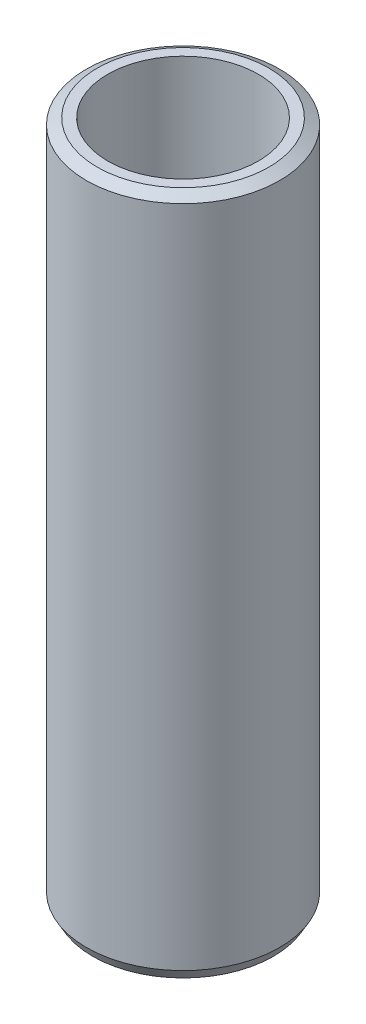
ISO-10303-21;
HEADER;
FILE_DESCRIPTION(('STEP AP214'),'2;1');
FILE_NAME('part.step','',(''),(''),'','','');
FILE_SCHEMA(('AUTOMOTIVE_DESIGN { 1 0 10303 214 1 1 1 1 }'));
ENDSEC;
DATA;
#1=APPLICATION_CONTEXT('core data for automotive mechanical design processes');
#2=APPLICATION_PROTOCOL_DEFINITION('international standard','automotive_design',2000,#1);
#3=PRODUCT_CONTEXT('',#1,'mechanical');
#4=PRODUCT('Part','Part','',(#3));
#5=PRODUCT_RELATED_PRODUCT_CATEGORY('part','',(#4));
#6=PRODUCT_DEFINITION_FORMATION('','',#4);
#7=PRODUCT_DEFINITION_CONTEXT('part definition',#1,'design');
#8=PRODUCT_DEFINITION('design','',#6,#7);
#9=PRODUCT_DEFINITION_SHAPE('','',#8);
#10=(LENGTH_UNIT() NAMED_UNIT(*) SI_UNIT(.MILLI.,.METRE.));
#11=(NAMED_UNIT(*) PLANE_ANGLE_UNIT() SI_UNIT($,.RADIAN.));
#12=(NAMED_UNIT(*) SI_UNIT($,.STERADIAN.) SOLID_ANGLE_UNIT());
#13=UNCERTAINTY_MEASURE_WITH_UNIT(LENGTH_MEASURE(1.E-05),#10,'distance_accuracy_value','');
#14=(GEOMETRIC_REPRESENTATION_CONTEXT(3) GLOBAL_UNCERTAINTY_ASSIGNED_CONTEXT((#13)) GLOBAL_UNIT_ASSIGNED_CONTEXT((#10,
#11,#12)) REPRESENTATION_CONTEXT('',''));
#15=CARTESIAN_POINT('',(0.,0.,0.));
#16=DIRECTION('',(0.,0.,1.));
#17=DIRECTION('',(1.,0.,0.));
#18=AXIS2_PLACEMENT_3D('',#15,#16,#17);
#19=CARTESIAN_POINT('',(0.,405.391041704947,0.));
#20=DIRECTION('',(0.,-1.,0.));
#21=DIRECTION('',(0.,0.,-1.));
#22=AXIS2_PLACEMENT_3D('',#19,#20,#21);
#23=CYLINDRICAL_SURFACE('',#22,57.5);
#24=CARTESIAN_POINT('',(0.,401.687644250712,0.));
#25=DIRECTION('',(0.,1.,0.));
#26=DIRECTION('',(0.,0.,1.));
#27=AXIS2_PLACEMENT_3D('',#24,#25,#26);
#28=CIRCLE('',#27,57.5);
#29=CARTESIAN_POINT('',(0.,401.687644250712,57.5));
#30=VERTEX_POINT('',#29);
#31=EDGE_CURVE('E50',#30,#30,#28,.F.);
#32=ORIENTED_EDGE('',*,*,#31,.T.);
#33=EDGE_LOOP('',(#32));
#34=FACE_BOUND('',#33,.T.);
#35=CARTESIAN_POINT('',(0.,6.41447255135585,0.));
#36=DIRECTION('',(0.,1.,0.));
#37=DIRECTION('',(0.,0.,1.));
#38=AXIS2_PLACEMENT_3D('',#35,#36,#37);
#39=CIRCLE('',#38,57.5);
#40=CARTESIAN_POINT('',(0.,6.41447255135585,57.5));
#41=VERTEX_POINT('',#40);
#42=EDGE_CURVE('E51',#41,#41,#39,.T.);
#43=ORIENTED_EDGE('',*,*,#42,.T.);
#44=EDGE_LOOP('',(#43));
#45=FACE_BOUND('',#44,.T.);
#46=ADVANCED_FACE('F39',(#34,#45),#23,.T.);
#47=CARTESIAN_POINT('',(0.,405.391041704947,0.));
#48=DIRECTION('',(0.,1.,0.));
#49=DIRECTION('',(0.,0.,1.));
#50=AXIS2_PLACEMENT_3D('',#47,#48,#49);
#51=PLANE('',#50);
#52=CARTESIAN_POINT('',(0.,405.391041704947,0.));
#53=DIRECTION('',(0.,1.,0.));
#54=DIRECTION('',(0.,0.,1.));
#55=AXIS2_PLACEMENT_3D('',#52,#53,#54);
#56=CIRCLE('',#55,51.0855274486441);
#57=CARTESIAN_POINT('',(0.,405.391041704947,51.0855274486441));
#58=VERTEX_POINT('',#57);
#59=EDGE_CURVE('E54',#58,#58,#56,.T.);
#60=ORIENTED_EDGE('',*,*,#59,.T.);
#61=EDGE_LOOP('',(#60));
#62=FACE_BOUND('',#61,.T.);
#63=CARTESIAN_POINT('',(0.,405.391041704947,0.));
#64=DIRECTION('',(0.,1.,0.));
#65=DIRECTION('',(0.,0.,1.));
#66=AXIS2_PLACEMENT_3D('',#63,#64,#65);
#67=CIRCLE('',#66,44.8034262332296);
#68=CARTESIAN_POINT('',(0.,405.391041704947,44.8034262332296));
#69=VERTEX_POINT('',#68);
#70=EDGE_CURVE('E58',#69,#69,#67,.T.);
#71=ORIENTED_EDGE('',*,*,#70,.F.);
#72=EDGE_LOOP('',(#71));
#73=FACE_BOUND('',#72,.T.);
#74=ADVANCED_FACE('F69',(#62,#73),#51,.T.);
#75=CARTESIAN_POINT('',(0.,0.,0.));
#76=DIRECTION('',(0.,1.,0.));
#77=DIRECTION('',(0.,0.,1.));
#78=AXIS2_PLACEMENT_3D('',#75,#76,#77);
#79=PLANE('',#78);
#80=CARTESIAN_POINT('',(0.,0.,0.));
#81=DIRECTION('',(0.,1.,0.));
#82=DIRECTION('',(0.,0.,1.));
#83=AXIS2_PLACEMENT_3D('',#80,#81,#82);
#84=CIRCLE('',#83,53.7966025457652);
#85=CARTESIAN_POINT('',(0.,0.,53.7966025457652));
#86=VERTEX_POINT('',#85);
#87=EDGE_CURVE('E10',#86,#86,#84,.F.);
#88=ORIENTED_EDGE('',*,*,#87,.T.);
#89=EDGE_LOOP('',(#88));
#90=FACE_BOUND('',#89,.T.);
#91=CARTESIAN_POINT('',(0.,0.,0.));
#92=DIRECTION('',(0.,1.,0.));
#93=DIRECTION('',(0.,0.,1.));
#94=AXIS2_PLACEMENT_3D('',#91,#92,#93);
#95=CIRCLE('',#94,44.8034262332296);
#96=CARTESIAN_POINT('',(0.,0.,44.8034262332296));
#97=VERTEX_POINT('',#96);
#98=EDGE_CURVE('E63',#97,#97,#95,.T.);
#99=ORIENTED_EDGE('',*,*,#98,.T.);
#100=EDGE_LOOP('',(#99));
#101=FACE_BOUND('',#100,.T.);
#102=ADVANCED_FACE('F75',(#90,#101),#79,.F.);
#103=CARTESIAN_POINT('',(0.,405.391041704947,0.));
#104=DIRECTION('',(0.,-1.,0.));
#105=DIRECTION('',(0.,0.,-1.));
#106=AXIS2_PLACEMENT_3D('',#103,#104,#105);
#107=CYLINDRICAL_SURFACE('',#106,44.8034262332296);
#108=ORIENTED_EDGE('',*,*,#70,.T.);
#109=EDGE_LOOP('',(#108));
#110=FACE_BOUND('',#109,.T.);
#111=ORIENTED_EDGE('',*,*,#98,.F.);
#112=EDGE_LOOP('',(#111));
#113=FACE_BOUND('',#112,.T.);
#114=ADVANCED_FACE('F70',(#110,#113),#107,.F.);
#115=CARTESIAN_POINT('',(0.,405.391041704947,0.));
#116=DIRECTION('',(0.,-1.,0.));
#117=DIRECTION('',(0.,0.,-1.));
#118=AXIS2_PLACEMENT_3D('',#115,#116,#117);
#119=CONICAL_SURFACE('',#118,51.0855274486441,1.04719755119659);
#120=ORIENTED_EDGE('',*,*,#31,.F.);
#121=EDGE_LOOP('',(#120));
#122=FACE_BOUND('',#121,.T.);
#123=ORIENTED_EDGE('',*,*,#59,.F.);
#124=EDGE_LOOP('',(#123));
#125=FACE_BOUND('',#124,.T.);
#126=ADVANCED_FACE('F81',(#122,#125),#119,.T.);
#127=CARTESIAN_POINT('',(0.,6.41447255135585,0.));
#128=DIRECTION('',(0.,1.,0.));
#129=DIRECTION('',(0.,0.,1.));
#130=AXIS2_PLACEMENT_3D('',#127,#128,#129);
#131=CONICAL_SURFACE('',#130,57.5,0.523598775598302);
#132=CARTESIAN_POINT('',(0.,0.,53.7966025457652));
#133=CARTESIAN_POINT('',(0.,0.0668174224099567,53.8351796025801));
#134=CARTESIAN_POINT('',(0.,0.133634844819913,53.8737566593951));
#135=CARTESIAN_POINT('',(0.,0.267269689639827,53.950910773025));
#136=CARTESIAN_POINT('',(0.,0.334087112049783,53.9894878298399));
#137=CARTESIAN_POINT('',(0.,0.467721956869697,54.0666419434698));
#138=CARTESIAN_POINT('',(0.,0.534539379279653,54.1052190002848));
#139=CARTESIAN_POINT('',(0.,0.668174224099567,54.1823731139147));
#140=CARTESIAN_POINT('',(0.,0.734991646509524,54.2209501707296));
#141=CARTESIAN_POINT('',(0.,0.868626491329438,54.2981042843595));
#142=CARTESIAN_POINT('',(0.,0.935443913739395,54.3366813411744));
#143=CARTESIAN_POINT('',(0.,1.06907875855931,54.4138354548043));
#144=CARTESIAN_POINT('',(0.,1.13589618096926,54.4524125116193));
#145=CARTESIAN_POINT('',(0.,1.26953102578918,54.5295666252492));
#146=CARTESIAN_POINT('',(0.,1.33634844819914,54.5681436820641));
#147=CARTESIAN_POINT('',(0.,1.46998329301905,54.645297795694));
#148=CARTESIAN_POINT('',(0.,1.53680071542901,54.683874852509));
#149=CARTESIAN_POINT('',(0.,1.67043556024892,54.7610289661389));
#150=CARTESIAN_POINT('',(0.,1.73725298265888,54.7996060229538));
#151=CARTESIAN_POINT('',(0.,1.87088782747879,54.8767601365837));
#152=CARTESIAN_POINT('',(0.,1.93770524988875,54.9153371933986));
#153=CARTESIAN_POINT('',(0.,2.07134009470866,54.9924913070285));
#154=CARTESIAN_POINT('',(0.,2.13815751711862,55.0310683638435));
#155=CARTESIAN_POINT('',(0.,2.27179236193853,55.1082224774734));
#156=CARTESIAN_POINT('',(0.,2.33860978434849,55.1467995342883));
#157=CARTESIAN_POINT('',(0.,2.4722446291684,55.2239536479182));
#158=CARTESIAN_POINT('',(0.,2.53906205157836,55.2625307047331));
#159=CARTESIAN_POINT('',(0.,2.67269689639827,55.339684818363));
#160=CARTESIAN_POINT('',(0.,2.73951431880823,55.378261875178));
#161=CARTESIAN_POINT('',(0.,2.87314916362814,55.4554159888079));
#162=CARTESIAN_POINT('',(0.,2.9399665860381,55.4939930456228));
#163=CARTESIAN_POINT('',(0.,3.07360143085801,55.5711471592527));
#164=CARTESIAN_POINT('',(0.,3.14041885326797,55.6097242160677));
#165=CARTESIAN_POINT('',(0.,3.27405369808788,55.6868783296975));
#166=CARTESIAN_POINT('',(0.,3.34087112049784,55.7254553865125));
#167=CARTESIAN_POINT('',(0.,3.47450596531775,55.8026095001424));
#168=CARTESIAN_POINT('',(0.,3.54132338772771,55.8411865569573));
#169=CARTESIAN_POINT('',(0.,3.67495823254762,55.9183406705872));
#170=CARTESIAN_POINT('',(0.,3.74177565495758,55.9569177274022));
#171=CARTESIAN_POINT('',(0.,3.8754104997775,56.0340718410321));
#172=CARTESIAN_POINT('',(0.,3.94222792218745,56.072648897847));
#173=CARTESIAN_POINT('',(0.,4.07586276700737,56.1498030114769));
#174=CARTESIAN_POINT('',(0.,4.14268018941732,56.1883800682918));
#175=CARTESIAN_POINT('',(0.,4.27631503423724,56.2655341819217));
#176=CARTESIAN_POINT('',(0.,4.34313245664719,56.3041112387367));
#177=CARTESIAN_POINT('',(0.,4.47676730146711,56.3812653523666));
#178=CARTESIAN_POINT('',(0.,4.54358472387706,56.4198424091815));
#179=CARTESIAN_POINT('',(0.,4.67721956869698,56.4969965228114));
#180=CARTESIAN_POINT('',(0.,4.74403699110693,56.5355735796264));
#181=CARTESIAN_POINT('',(0.,4.87767183592685,56.6127276932563));
#182=CARTESIAN_POINT('',(0.,4.94448925833681,56.6513047500712));
#183=CARTESIAN_POINT('',(0.,5.07812410315672,56.7284588637011));
#184=CARTESIAN_POINT('',(0.,5.14494152556668,56.767035920516));
#185=CARTESIAN_POINT('',(0.,5.27857637038659,56.8441900341459));
#186=CARTESIAN_POINT('',(0.,5.34539379279655,56.8827670909609));
#187=CARTESIAN_POINT('',(0.,5.47902863761646,56.9599212045908));
#188=CARTESIAN_POINT('',(0.,5.54584606002642,56.9984982614057));
#189=CARTESIAN_POINT('',(0.,5.67948090484633,57.0756523750356));
#190=CARTESIAN_POINT('',(0.,5.74629832725629,57.1142294318505));
#191=CARTESIAN_POINT('',(0.,5.8799331720762,57.1913835454804));
#192=CARTESIAN_POINT('',(0.,5.94675059448616,57.2299606022954));
#193=CARTESIAN_POINT('',(0.,6.08038543930607,57.3071147159253));
#194=CARTESIAN_POINT('',(0.,6.14720286171603,57.3456917727402));
#195=CARTESIAN_POINT('',(0.,6.28083770653594,57.4228458863701));
#196=CARTESIAN_POINT('',(0.,6.3476551289459,57.4614229431851));
#197=CARTESIAN_POINT('',(0.,6.41447255135585,57.5));
#198=B_SPLINE_CURVE_WITH_KNOTS('',3,(#132,#133,#134,#135,#136,#137,#138,#139,#140,#141,#142,
#143,#144,#145,#146,#147,#148,#149,#150,#151,#152,#153,#154,#155,#156,#157,#158,#159,#160,#161,
#162,#163,#164,#165,#166,#167,#168,#169,#170,#171,#172,#173,#174,#175,#176,#177,#178,#179,#180,
#181,#182,#183,#184,#185,#186,#187,#188,#189,#190,#191,#192,#193,#194,#195,#196,#197),
.UNSPECIFIED.,.F.,.F.,(4,2,2,2,2,2,2,2,2,2,2,2,2,2,2,2,2,2,2,2,2,2,2,2,2,2,2,2,2,2,2,2,4),(0.,
0.231462340889671,0.462924681779346,0.69438702266902,0.925849363558691,1.15731170444837,
1.38877404533804,1.62023638622771,1.85169872711739,2.08316106800706,2.31462340889673,
2.54608574978641,2.77754809067608,3.00901043156575,3.24047277245543,3.4719351133451,
3.70339745423477,3.93485979512445,4.16632213601412,4.39778447690379,4.62924681779347,
4.86070915868314,5.09217149957282,5.32363384046249,5.55509618135217,5.78655852224184,
6.01802086313151,6.24948320402119,6.48094554491086,6.71240788580053,6.94387022669021,
7.17533256757988,7.40679490846955),.UNSPECIFIED.);
#199=EDGE_CURVE('BSEAM45',#86,#41,#198,.T.);
#200=ORIENTED_EDGE('',*,*,#87,.F.);
#201=ORIENTED_EDGE('',*,*,#42,.F.);
#202=ORIENTED_EDGE('',*,*,#199,.T.);
#203=ORIENTED_EDGE('',*,*,#199,.F.);
#204=EDGE_LOOP('',(#200,#202,#201,#203));
#205=FACE_BOUND('',#204,.T.);
#206=ADVANCED_FACE('F45',(#205),#131,.T.);
#207=CLOSED_SHELL('',(#46,#74,#102,#114,#126,#206));
#208=MANIFOLD_SOLID_BREP('B2',#207);
#209=ADVANCED_BREP_SHAPE_REPRESENTATION('',(#18,#208),#14);
#210=SHAPE_DEFINITION_REPRESENTATION(#9,#209);
ENDSEC;
END-ISO-10303-21;
